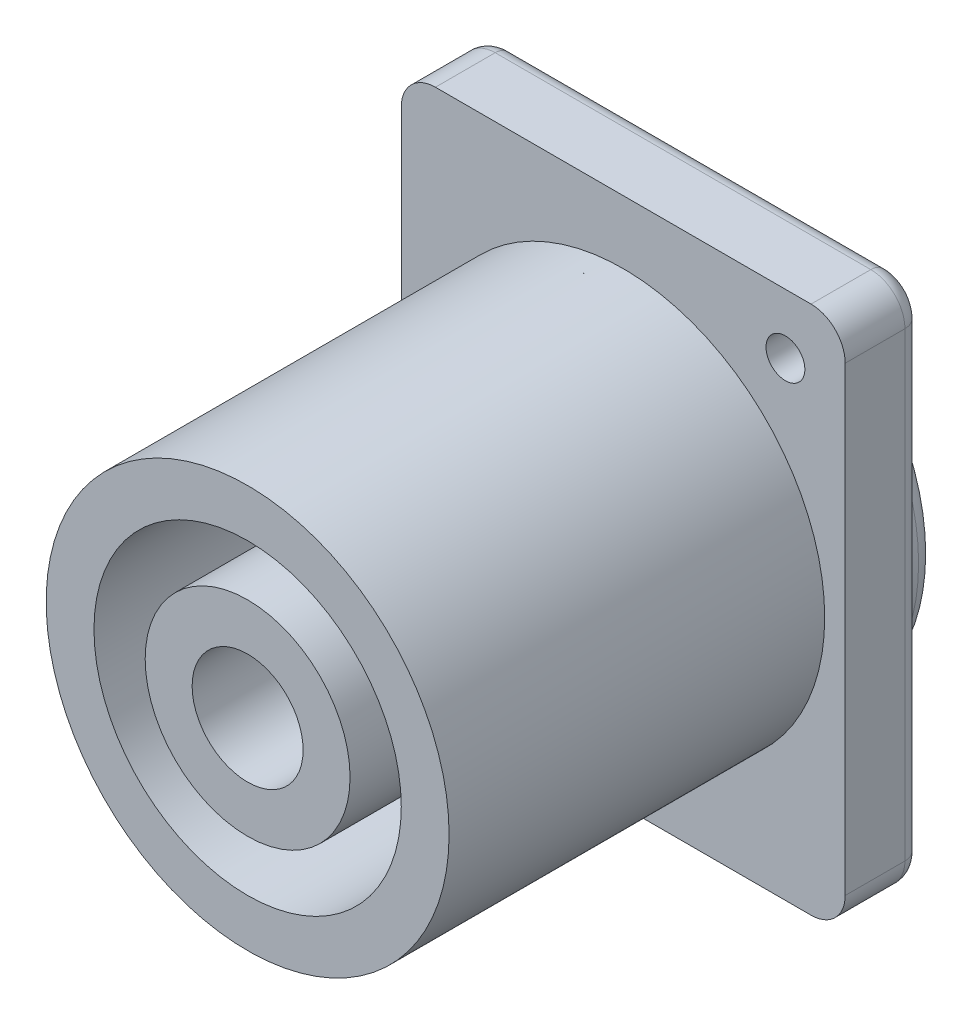
ISO-10303-21;
HEADER;
FILE_DESCRIPTION(('STEP AP214'),'2;1');
FILE_NAME('part.step','',(''),(''),'','','');
FILE_SCHEMA(('AUTOMOTIVE_DESIGN { 1 0 10303 214 1 1 1 1 }'));
ENDSEC;
DATA;
#1=APPLICATION_CONTEXT('core data for automotive mechanical design processes');
#2=APPLICATION_PROTOCOL_DEFINITION('international standard','automotive_design',2000,#1);
#3=PRODUCT_CONTEXT('',#1,'mechanical');
#4=PRODUCT('Part','Part','',(#3));
#5=PRODUCT_RELATED_PRODUCT_CATEGORY('part','',(#4));
#6=PRODUCT_DEFINITION_FORMATION('','',#4);
#7=PRODUCT_DEFINITION_CONTEXT('part definition',#1,'design');
#8=PRODUCT_DEFINITION('design','',#6,#7);
#9=PRODUCT_DEFINITION_SHAPE('','',#8);
#10=(LENGTH_UNIT() NAMED_UNIT(*) SI_UNIT(.MILLI.,.METRE.));
#11=(NAMED_UNIT(*) PLANE_ANGLE_UNIT() SI_UNIT($,.RADIAN.));
#12=(NAMED_UNIT(*) SI_UNIT($,.STERADIAN.) SOLID_ANGLE_UNIT());
#13=UNCERTAINTY_MEASURE_WITH_UNIT(LENGTH_MEASURE(1.E-05),#10,'distance_accuracy_value','');
#14=(GEOMETRIC_REPRESENTATION_CONTEXT(3) GLOBAL_UNCERTAINTY_ASSIGNED_CONTEXT((#13)) GLOBAL_UNIT_ASSIGNED_CONTEXT((#10,
#11,#12)) REPRESENTATION_CONTEXT('',''));
#15=CARTESIAN_POINT('',(0.,0.,0.));
#16=DIRECTION('',(0.,0.,1.));
#17=DIRECTION('',(1.,0.,0.));
#18=AXIS2_PLACEMENT_3D('',#15,#16,#17);
#19=CARTESIAN_POINT('',(0.,0.,4.5));
#20=DIRECTION('',(0.,0.,1.));
#21=DIRECTION('',(1.,0.,0.));
#22=AXIS2_PLACEMENT_3D('',#19,#20,#21);
#23=PLANE('',#22);
#24=CARTESIAN_POINT('',(-6.93648290047212,-3.7621359223301,4.5));
#25=DIRECTION('',(0.,0.,1.));
#26=DIRECTION('',(1.,0.,0.));
#27=AXIS2_PLACEMENT_3D('',#24,#25,#26);
#28=CIRCLE('',#27,11.8);
#29=CARTESIAN_POINT('',(4.86351709952788,-3.7621359223301,4.5));
#30=VERTEX_POINT('',#29);
#31=EDGE_CURVE('E257',#30,#30,#28,.T.);
#32=ORIENTED_EDGE('',*,*,#31,.F.);
#33=EDGE_LOOP('',(#32));
#34=FACE_BOUND('',#33,.T.);
#35=CARTESIAN_POINT('',(2.56351709952788,8.2378640776699,4.5));
#36=DIRECTION('',(0.,0.,1.));
#37=DIRECTION('',(1.,0.,0.));
#38=AXIS2_PLACEMENT_3D('',#35,#36,#37);
#39=CIRCLE('',#38,1.13750779244328);
#40=CARTESIAN_POINT('',(3.70102489197115,8.2378640776699,4.5));
#41=VERTEX_POINT('',#40);
#42=EDGE_CURVE('E239',#41,#41,#39,.T.);
#43=ORIENTED_EDGE('',*,*,#42,.F.);
#44=EDGE_LOOP('',(#43));
#45=FACE_BOUND('',#44,.T.);
#46=DIRECTION('',(0.,1.,0.));
#47=VECTOR('',#46,1.);
#48=CARTESIAN_POINT('',(6.06351709952788,11.7378640776699,4.5));
#49=LINE('',#48,#47);
#50=CARTESIAN_POINT('',(6.06351709952788,-17.2621359223301,4.5));
#51=VERTEX_POINT('',#50);
#52=CARTESIAN_POINT('',(6.06351709952788,9.7378640776699,4.5));
#53=VERTEX_POINT('',#52);
#54=EDGE_CURVE('E223',#51,#53,#49,.T.);
#55=ORIENTED_EDGE('',*,*,#54,.T.);
#56=CARTESIAN_POINT('',(4.06351709952788,9.7378640776699,4.5));
#57=DIRECTION('',(0.,0.,1.));
#58=DIRECTION('',(1.,0.,0.));
#59=AXIS2_PLACEMENT_3D('',#56,#57,#58);
#60=CIRCLE('',#59,2.);
#61=CARTESIAN_POINT('',(4.06351709952787,11.7378640776699,4.5));
#62=VERTEX_POINT('',#61);
#63=EDGE_CURVE('E219',#53,#62,#60,.T.);
#64=ORIENTED_EDGE('',*,*,#63,.T.);
#65=DIRECTION('',(-1.,0.,0.));
#66=VECTOR('',#65,1.);
#67=CARTESIAN_POINT('',(-19.9364829004721,11.7378640776699,4.5));
#68=LINE('',#67,#66);
#69=CARTESIAN_POINT('',(-17.9364829004721,11.7378640776699,4.5));
#70=VERTEX_POINT('',#69);
#71=EDGE_CURVE('E222',#62,#70,#68,.T.);
#72=ORIENTED_EDGE('',*,*,#71,.T.);
#73=CARTESIAN_POINT('',(-17.9364829004721,9.7378640776699,4.5));
#74=DIRECTION('',(0.,0.,1.));
#75=DIRECTION('',(1.,0.,0.));
#76=AXIS2_PLACEMENT_3D('',#73,#74,#75);
#77=CIRCLE('',#76,2.);
#78=CARTESIAN_POINT('',(-19.9364829004721,9.7378640776699,4.5));
#79=VERTEX_POINT('',#78);
#80=EDGE_CURVE('E229',#70,#79,#77,.T.);
#81=ORIENTED_EDGE('',*,*,#80,.T.);
#82=DIRECTION('',(0.,-1.,0.));
#83=VECTOR('',#82,1.);
#84=CARTESIAN_POINT('',(-19.9364829004721,11.7378640776699,4.5));
#85=LINE('',#84,#83);
#86=CARTESIAN_POINT('',(-19.9364829004721,-17.2621359223301,4.5));
#87=VERTEX_POINT('',#86);
#88=EDGE_CURVE('E228',#79,#87,#85,.T.);
#89=ORIENTED_EDGE('',*,*,#88,.T.);
#90=CARTESIAN_POINT('',(-17.9364829004721,-17.2621359223301,4.5));
#91=DIRECTION('',(0.,0.,1.));
#92=DIRECTION('',(1.,0.,0.));
#93=AXIS2_PLACEMENT_3D('',#90,#91,#92);
#94=CIRCLE('',#93,2.);
#95=CARTESIAN_POINT('',(-17.9364829004721,-19.2621359223301,4.5));
#96=VERTEX_POINT('',#95);
#97=EDGE_CURVE('E226',#87,#96,#94,.T.);
#98=ORIENTED_EDGE('',*,*,#97,.T.);
#99=DIRECTION('',(1.,0.,0.));
#100=VECTOR('',#99,1.);
#101=CARTESIAN_POINT('',(-19.9364829004721,-19.2621359223301,4.5));
#102=LINE('',#101,#100);
#103=CARTESIAN_POINT('',(4.06351709952787,-19.2621359223301,4.5));
#104=VERTEX_POINT('',#103);
#105=EDGE_CURVE('E225',#96,#104,#102,.T.);
#106=ORIENTED_EDGE('',*,*,#105,.T.);
#107=CARTESIAN_POINT('',(4.06351709952788,-17.2621359223301,4.5));
#108=DIRECTION('',(0.,0.,1.));
#109=DIRECTION('',(1.,0.,0.));
#110=AXIS2_PLACEMENT_3D('',#107,#108,#109);
#111=CIRCLE('',#110,2.);
#112=EDGE_CURVE('E163',#104,#51,#111,.T.);
#113=ORIENTED_EDGE('',*,*,#112,.T.);
#114=EDGE_LOOP('',(#55,#64,#72,#81,#89,#98,#106,#113));
#115=FACE_BOUND('',#114,.T.);
#116=CARTESIAN_POINT('',(-16.4364829004721,-15.7621359223301,4.5));
#117=DIRECTION('',(0.,0.,1.));
#118=DIRECTION('',(1.,0.,0.));
#119=AXIS2_PLACEMENT_3D('',#116,#117,#118);
#120=CIRCLE('',#119,1.23529565645922);
#121=CARTESIAN_POINT('',(-15.2011872440129,-15.7621359223301,4.5));
#122=VERTEX_POINT('',#121);
#123=EDGE_CURVE('E187',#122,#122,#120,.T.);
#124=ORIENTED_EDGE('',*,*,#123,.F.);
#125=EDGE_LOOP('',(#124));
#126=FACE_BOUND('',#125,.T.);
#127=ADVANCED_FACE('F50',(#34,#45,#115,#126),#23,.T.);
#128=CARTESIAN_POINT('',(0.,0.,0.));
#129=DIRECTION('',(0.,0.,1.));
#130=DIRECTION('',(1.,0.,0.));
#131=AXIS2_PLACEMENT_3D('',#128,#129,#130);
#132=PLANE('',#131);
#133=CARTESIAN_POINT('',(-6.93648290047212,-3.7621359223301,0.));
#134=DIRECTION('',(0.,0.,1.));
#135=DIRECTION('',(1.,0.,0.));
#136=AXIS2_PLACEMENT_3D('',#133,#134,#135);
#137=CIRCLE('',#136,11.8);
#138=CARTESIAN_POINT('',(4.86351709952789,-3.7621359223301,0.));
#139=VERTEX_POINT('',#138);
#140=EDGE_CURVE('E272',#139,#139,#137,.F.);
#141=ORIENTED_EDGE('',*,*,#140,.F.);
#142=EDGE_LOOP('',(#141));
#143=FACE_BOUND('',#142,.T.);
#144=DIRECTION('',(-1.,0.,0.));
#145=VECTOR('',#144,1.);
#146=CARTESIAN_POINT('',(0.,10.7378640776699,0.));
#147=LINE('',#146,#145);
#148=CARTESIAN_POINT('',(-17.9364829004721,10.7378640776699,0.));
#149=VERTEX_POINT('',#148);
#150=CARTESIAN_POINT('',(4.06351709952788,10.7378640776699,0.));
#151=VERTEX_POINT('',#150);
#152=EDGE_CURVE('E198',#149,#151,#147,.F.);
#153=ORIENTED_EDGE('',*,*,#152,.T.);
#154=CARTESIAN_POINT('',(4.06351709952788,9.7378640776699,0.));
#155=DIRECTION('',(0.,0.,1.));
#156=DIRECTION('',(1.,0.,0.));
#157=AXIS2_PLACEMENT_3D('',#154,#155,#156);
#158=CIRCLE('',#157,1.);
#159=CARTESIAN_POINT('',(5.06351709952788,9.7378640776699,0.));
#160=VERTEX_POINT('',#159);
#161=EDGE_CURVE('E194',#151,#160,#158,.F.);
#162=ORIENTED_EDGE('',*,*,#161,.T.);
#163=DIRECTION('',(0.,1.,0.));
#164=VECTOR('',#163,1.);
#165=CARTESIAN_POINT('',(5.06351709952788,0.,0.));
#166=LINE('',#165,#164);
#167=CARTESIAN_POINT('',(5.06351709952788,-17.2621359223301,0.));
#168=VERTEX_POINT('',#167);
#169=EDGE_CURVE('E197',#160,#168,#166,.F.);
#170=ORIENTED_EDGE('',*,*,#169,.T.);
#171=CARTESIAN_POINT('',(4.06351709952788,-17.2621359223301,0.));
#172=DIRECTION('',(0.,0.,1.));
#173=DIRECTION('',(1.,0.,0.));
#174=AXIS2_PLACEMENT_3D('',#171,#172,#173);
#175=CIRCLE('',#174,1.);
#176=CARTESIAN_POINT('',(4.06351709952788,-18.2621359223301,0.));
#177=VERTEX_POINT('',#176);
#178=EDGE_CURVE('E200',#168,#177,#175,.F.);
#179=ORIENTED_EDGE('',*,*,#178,.T.);
#180=DIRECTION('',(1.,0.,0.));
#181=VECTOR('',#180,1.);
#182=CARTESIAN_POINT('',(0.,-18.2621359223301,0.));
#183=LINE('',#182,#181);
#184=CARTESIAN_POINT('',(-17.9364829004721,-18.2621359223301,0.));
#185=VERTEX_POINT('',#184);
#186=EDGE_CURVE('E170',#177,#185,#183,.F.);
#187=ORIENTED_EDGE('',*,*,#186,.T.);
#188=CARTESIAN_POINT('',(-17.9364829004721,-17.2621359223301,0.));
#189=DIRECTION('',(0.,0.,1.));
#190=DIRECTION('',(1.,0.,0.));
#191=AXIS2_PLACEMENT_3D('',#188,#189,#190);
#192=CIRCLE('',#191,1.);
#193=CARTESIAN_POINT('',(-18.9364829004721,-17.2621359223301,0.));
#194=VERTEX_POINT('',#193);
#195=EDGE_CURVE('E203',#185,#194,#192,.F.);
#196=ORIENTED_EDGE('',*,*,#195,.T.);
#197=DIRECTION('',(0.,-1.,0.));
#198=VECTOR('',#197,1.);
#199=CARTESIAN_POINT('',(-18.9364829004721,0.,0.));
#200=LINE('',#199,#198);
#201=CARTESIAN_POINT('',(-18.9364829004721,9.7378640776699,0.));
#202=VERTEX_POINT('',#201);
#203=EDGE_CURVE('E205',#194,#202,#200,.F.);
#204=ORIENTED_EDGE('',*,*,#203,.T.);
#205=CARTESIAN_POINT('',(-17.9364829004721,9.7378640776699,0.));
#206=DIRECTION('',(0.,0.,1.));
#207=DIRECTION('',(1.,0.,0.));
#208=AXIS2_PLACEMENT_3D('',#205,#206,#207);
#209=CIRCLE('',#208,1.);
#210=EDGE_CURVE('E207',#202,#149,#209,.F.);
#211=ORIENTED_EDGE('',*,*,#210,.T.);
#212=EDGE_LOOP('',(#153,#162,#170,#179,#187,#196,#204,#211));
#213=FACE_BOUND('',#212,.T.);
#214=CARTESIAN_POINT('',(-16.4364829004721,-15.7621359223301,0.));
#215=DIRECTION('',(0.,0.,1.));
#216=DIRECTION('',(1.,0.,0.));
#217=AXIS2_PLACEMENT_3D('',#214,#215,#216);
#218=CIRCLE('',#217,2.23529565645922);
#219=CARTESIAN_POINT('',(-14.2011872440129,-15.7621359223301,0.));
#220=VERTEX_POINT('',#219);
#221=EDGE_CURVE('E209',#220,#220,#218,.T.);
#222=ORIENTED_EDGE('',*,*,#221,.T.);
#223=EDGE_LOOP('',(#222));
#224=FACE_BOUND('',#223,.T.);
#225=CARTESIAN_POINT('',(2.56351709952788,8.2378640776699,0.));
#226=DIRECTION('',(0.,0.,1.));
#227=DIRECTION('',(1.,0.,0.));
#228=AXIS2_PLACEMENT_3D('',#225,#226,#227);
#229=CIRCLE('',#228,2.13750779244328);
#230=CARTESIAN_POINT('',(4.70102489197116,8.2378640776699,0.));
#231=VERTEX_POINT('',#230);
#232=EDGE_CURVE('E216',#231,#231,#229,.T.);
#233=ORIENTED_EDGE('',*,*,#232,.T.);
#234=EDGE_LOOP('',(#233));
#235=FACE_BOUND('',#234,.T.);
#236=ADVANCED_FACE('F312',(#143,#213,#224,#235),#132,.F.);
#237=CARTESIAN_POINT('',(-19.9364829004721,11.7378640776699,4.5));
#238=DIRECTION('',(1.,0.,0.));
#239=DIRECTION('',(0.,1.,0.));
#240=AXIS2_PLACEMENT_3D('',#237,#238,#239);
#241=PLANE('',#240);
#242=DIRECTION('',(0.,0.,-1.));
#243=VECTOR('',#242,1.);
#244=CARTESIAN_POINT('',(-19.9364829004721,9.7378640776699,4.5));
#245=LINE('',#244,#243);
#246=CARTESIAN_POINT('',(-19.9364829004721,9.7378640776699,1.));
#247=VERTEX_POINT('',#246);
#248=EDGE_CURVE('E214',#79,#247,#245,.T.);
#249=ORIENTED_EDGE('',*,*,#248,.T.);
#250=DIRECTION('',(0.,-1.,0.));
#251=VECTOR('',#250,1.);
#252=CARTESIAN_POINT('',(-19.9364829004721,11.7378640776699,1.));
#253=LINE('',#252,#251);
#254=CARTESIAN_POINT('',(-19.9364829004721,-17.2621359223301,1.));
#255=VERTEX_POINT('',#254);
#256=EDGE_CURVE('E213',#247,#255,#253,.T.);
#257=ORIENTED_EDGE('',*,*,#256,.T.);
#258=DIRECTION('',(0.,0.,-1.));
#259=VECTOR('',#258,1.);
#260=CARTESIAN_POINT('',(-19.9364829004721,-17.2621359223301,4.5));
#261=LINE('',#260,#259);
#262=EDGE_CURVE('E211',#255,#87,#261,.F.);
#263=ORIENTED_EDGE('',*,*,#262,.T.);
#264=ORIENTED_EDGE('',*,*,#88,.F.);
#265=EDGE_LOOP('',(#249,#257,#263,#264));
#266=FACE_BOUND('',#265,.T.);
#267=ADVANCED_FACE('F295',(#266),#241,.F.);
#268=CARTESIAN_POINT('',(-19.9364829004721,-19.2621359223301,4.5));
#269=DIRECTION('',(0.,1.,0.));
#270=DIRECTION('',(0.,0.,1.));
#271=AXIS2_PLACEMENT_3D('',#268,#269,#270);
#272=PLANE('',#271);
#273=DIRECTION('',(0.,0.,-1.));
#274=VECTOR('',#273,1.);
#275=CARTESIAN_POINT('',(-17.9364829004721,-19.2621359223301,4.5));
#276=LINE('',#275,#274);
#277=CARTESIAN_POINT('',(-17.9364829004721,-19.2621359223301,1.));
#278=VERTEX_POINT('',#277);
#279=EDGE_CURVE('E150',#96,#278,#276,.T.);
#280=ORIENTED_EDGE('',*,*,#279,.T.);
#281=DIRECTION('',(1.,0.,0.));
#282=VECTOR('',#281,1.);
#283=CARTESIAN_POINT('',(-19.9364829004721,-19.2621359223301,1.));
#284=LINE('',#283,#282);
#285=CARTESIAN_POINT('',(4.06351709952788,-19.2621359223301,1.));
#286=VERTEX_POINT('',#285);
#287=EDGE_CURVE('E143',#278,#286,#284,.T.);
#288=ORIENTED_EDGE('',*,*,#287,.T.);
#289=DIRECTION('',(0.,0.,-1.));
#290=VECTOR('',#289,1.);
#291=CARTESIAN_POINT('',(4.06351709952788,-19.2621359223301,4.5));
#292=LINE('',#291,#290);
#293=EDGE_CURVE('E147',#286,#104,#292,.F.);
#294=ORIENTED_EDGE('',*,*,#293,.T.);
#295=ORIENTED_EDGE('',*,*,#105,.F.);
#296=EDGE_LOOP('',(#280,#288,#294,#295));
#297=FACE_BOUND('',#296,.T.);
#298=ADVANCED_FACE('F145',(#297),#272,.F.);
#299=CARTESIAN_POINT('',(6.06351709952788,11.7378640776699,4.5));
#300=DIRECTION('',(-1.,0.,0.));
#301=DIRECTION('',(0.,-1.,0.));
#302=AXIS2_PLACEMENT_3D('',#299,#300,#301);
#303=PLANE('',#302);
#304=DIRECTION('',(0.,0.,-1.));
#305=VECTOR('',#304,1.);
#306=CARTESIAN_POINT('',(6.06351709952788,-17.2621359223301,4.5));
#307=LINE('',#306,#305);
#308=CARTESIAN_POINT('',(6.06351709952788,-17.2621359223301,1.));
#309=VERTEX_POINT('',#308);
#310=EDGE_CURVE('E164',#51,#309,#307,.T.);
#311=ORIENTED_EDGE('',*,*,#310,.T.);
#312=DIRECTION('',(0.,1.,0.));
#313=VECTOR('',#312,1.);
#314=CARTESIAN_POINT('',(6.06351709952788,11.7378640776699,1.));
#315=LINE('',#314,#313);
#316=CARTESIAN_POINT('',(6.06351709952788,9.7378640776699,1.));
#317=VERTEX_POINT('',#316);
#318=EDGE_CURVE('E190',#309,#317,#315,.T.);
#319=ORIENTED_EDGE('',*,*,#318,.T.);
#320=DIRECTION('',(0.,0.,-1.));
#321=VECTOR('',#320,1.);
#322=CARTESIAN_POINT('',(6.06351709952788,9.7378640776699,4.5));
#323=LINE('',#322,#321);
#324=EDGE_CURVE('E192',#317,#53,#323,.F.);
#325=ORIENTED_EDGE('',*,*,#324,.T.);
#326=ORIENTED_EDGE('',*,*,#54,.F.);
#327=EDGE_LOOP('',(#311,#319,#325,#326));
#328=FACE_BOUND('',#327,.T.);
#329=ADVANCED_FACE('F319',(#328),#303,.F.);
#330=CARTESIAN_POINT('',(-19.9364829004721,11.7378640776699,4.5));
#331=DIRECTION('',(0.,-1.,0.));
#332=DIRECTION('',(0.,0.,-1.));
#333=AXIS2_PLACEMENT_3D('',#330,#331,#332);
#334=PLANE('',#333);
#335=DIRECTION('',(0.,0.,-1.));
#336=VECTOR('',#335,1.);
#337=CARTESIAN_POINT('',(4.06351709952788,11.7378640776699,4.5));
#338=LINE('',#337,#336);
#339=CARTESIAN_POINT('',(4.06351709952788,11.7378640776699,1.));
#340=VERTEX_POINT('',#339);
#341=EDGE_CURVE('E232',#62,#340,#338,.T.);
#342=ORIENTED_EDGE('',*,*,#341,.T.);
#343=DIRECTION('',(-1.,0.,0.));
#344=VECTOR('',#343,1.);
#345=CARTESIAN_POINT('',(-19.9364829004721,11.7378640776699,1.));
#346=LINE('',#345,#344);
#347=CARTESIAN_POINT('',(-17.9364829004721,11.7378640776699,1.));
#348=VERTEX_POINT('',#347);
#349=EDGE_CURVE('E131',#340,#348,#346,.T.);
#350=ORIENTED_EDGE('',*,*,#349,.T.);
#351=DIRECTION('',(0.,0.,-1.));
#352=VECTOR('',#351,1.);
#353=CARTESIAN_POINT('',(-17.9364829004721,11.7378640776699,4.5));
#354=LINE('',#353,#352);
#355=EDGE_CURVE('E123',#348,#70,#354,.F.);
#356=ORIENTED_EDGE('',*,*,#355,.T.);
#357=ORIENTED_EDGE('',*,*,#71,.F.);
#358=EDGE_LOOP('',(#342,#350,#356,#357));
#359=FACE_BOUND('',#358,.T.);
#360=ADVANCED_FACE('F338',(#359),#334,.F.);
#361=CARTESIAN_POINT('',(2.56351709952788,8.2378640776699,4.5));
#362=DIRECTION('',(0.,0.,-1.));
#363=DIRECTION('',(-1.,0.,0.));
#364=AXIS2_PLACEMENT_3D('',#361,#362,#363);
#365=CYLINDRICAL_SURFACE('',#364,1.13750779244328);
#366=CARTESIAN_POINT('',(2.56351709952788,8.2378640776699,1.00000000000001));
#367=DIRECTION('',(0.,0.,1.));
#368=DIRECTION('',(1.,0.,0.));
#369=AXIS2_PLACEMENT_3D('',#366,#367,#368);
#370=CIRCLE('',#369,1.13750779244328);
#371=CARTESIAN_POINT('',(3.70102489197115,8.2378640776699,1.00000000000001));
#372=VERTEX_POINT('',#371);
#373=EDGE_CURVE('E236',#372,#372,#370,.F.);
#374=ORIENTED_EDGE('',*,*,#373,.T.);
#375=EDGE_LOOP('',(#374));
#376=FACE_BOUND('',#375,.T.);
#377=ORIENTED_EDGE('',*,*,#42,.T.);
#378=EDGE_LOOP('',(#377));
#379=FACE_BOUND('',#378,.T.);
#380=ADVANCED_FACE('F340',(#376,#379),#365,.F.);
#381=CARTESIAN_POINT('',(-16.4364829004721,-15.7621359223301,4.5));
#382=DIRECTION('',(0.,0.,-1.));
#383=DIRECTION('',(-1.,0.,0.));
#384=AXIS2_PLACEMENT_3D('',#381,#382,#383);
#385=CYLINDRICAL_SURFACE('',#384,1.23529565645922);
#386=CARTESIAN_POINT('',(-16.4364829004721,-15.7621359223301,1.00000000000001));
#387=DIRECTION('',(0.,0.,1.));
#388=DIRECTION('',(1.,0.,0.));
#389=AXIS2_PLACEMENT_3D('',#386,#387,#388);
#390=CIRCLE('',#389,1.23529565645922);
#391=CARTESIAN_POINT('',(-15.2011872440129,-15.7621359223301,1.00000000000001));
#392=VERTEX_POINT('',#391);
#393=EDGE_CURVE('E240',#392,#392,#390,.F.);
#394=ORIENTED_EDGE('',*,*,#393,.T.);
#395=EDGE_LOOP('',(#394));
#396=FACE_BOUND('',#395,.T.);
#397=ORIENTED_EDGE('',*,*,#123,.T.);
#398=EDGE_LOOP('',(#397));
#399=FACE_BOUND('',#398,.T.);
#400=ADVANCED_FACE('F346',(#396,#399),#385,.F.);
#401=CARTESIAN_POINT('',(-16.4364829004721,-15.7621359223301,0.));
#402=DIRECTION('',(0.,0.,-1.));
#403=DIRECTION('',(-1.,0.,0.));
#404=AXIS2_PLACEMENT_3D('',#401,#402,#403);
#405=CONICAL_SURFACE('',#404,2.23529565645922,0.785398163397447);
#406=ORIENTED_EDGE('',*,*,#393,.F.);
#407=EDGE_LOOP('',(#406));
#408=FACE_BOUND('',#407,.T.);
#409=ORIENTED_EDGE('',*,*,#221,.F.);
#410=EDGE_LOOP('',(#409));
#411=FACE_BOUND('',#410,.T.);
#412=ADVANCED_FACE('F363',(#408,#411),#405,.F.);
#413=CARTESIAN_POINT('',(2.56351709952788,8.2378640776699,0.));
#414=DIRECTION('',(0.,0.,-1.));
#415=DIRECTION('',(-1.,0.,0.));
#416=AXIS2_PLACEMENT_3D('',#413,#414,#415);
#417=CONICAL_SURFACE('',#416,2.13750779244328,0.785398163397445);
#418=ORIENTED_EDGE('',*,*,#373,.F.);
#419=EDGE_LOOP('',(#418));
#420=FACE_BOUND('',#419,.T.);
#421=ORIENTED_EDGE('',*,*,#232,.F.);
#422=EDGE_LOOP('',(#421));
#423=FACE_BOUND('',#422,.T.);
#424=ADVANCED_FACE('F508',(#420,#423),#417,.F.);
#425=CARTESIAN_POINT('',(4.06351709952788,9.7378640776699,4.5));
#426=DIRECTION('',(0.,0.,-1.));
#427=DIRECTION('',(-1.,0.,0.));
#428=AXIS2_PLACEMENT_3D('',#425,#426,#427);
#429=CYLINDRICAL_SURFACE('',#428,2.);
#430=ORIENTED_EDGE('',*,*,#324,.F.);
#431=CARTESIAN_POINT('',(4.06351709952788,9.7378640776699,1.));
#432=DIRECTION('',(0.,0.,1.));
#433=DIRECTION('',(1.,0.,0.));
#434=AXIS2_PLACEMENT_3D('',#431,#432,#433);
#435=CIRCLE('',#434,2.);
#436=EDGE_CURVE('E182',#317,#340,#435,.T.);
#437=ORIENTED_EDGE('',*,*,#436,.T.);
#438=ORIENTED_EDGE('',*,*,#341,.F.);
#439=ORIENTED_EDGE('',*,*,#63,.F.);
#440=EDGE_LOOP('',(#430,#437,#438,#439));
#441=FACE_BOUND('',#440,.T.);
#442=ADVANCED_FACE('F323',(#441),#429,.T.);
#443=CARTESIAN_POINT('',(4.06351709952788,-17.2621359223301,4.5));
#444=DIRECTION('',(0.,0.,-1.));
#445=DIRECTION('',(-1.,0.,0.));
#446=AXIS2_PLACEMENT_3D('',#443,#444,#445);
#447=CYLINDRICAL_SURFACE('',#446,2.);
#448=ORIENTED_EDGE('',*,*,#293,.F.);
#449=CARTESIAN_POINT('',(4.06351709952788,-17.2621359223301,1.));
#450=DIRECTION('',(0.,0.,1.));
#451=DIRECTION('',(1.,0.,0.));
#452=AXIS2_PLACEMENT_3D('',#449,#450,#451);
#453=CIRCLE('',#452,2.);
#454=EDGE_CURVE('E161',#286,#309,#453,.T.);
#455=ORIENTED_EDGE('',*,*,#454,.T.);
#456=ORIENTED_EDGE('',*,*,#310,.F.);
#457=ORIENTED_EDGE('',*,*,#112,.F.);
#458=EDGE_LOOP('',(#448,#455,#456,#457));
#459=FACE_BOUND('',#458,.T.);
#460=ADVANCED_FACE('F158',(#459),#447,.T.);
#461=CARTESIAN_POINT('',(-17.9364829004721,-17.2621359223301,4.5));
#462=DIRECTION('',(0.,0.,-1.));
#463=DIRECTION('',(-1.,0.,0.));
#464=AXIS2_PLACEMENT_3D('',#461,#462,#463);
#465=CYLINDRICAL_SURFACE('',#464,2.);
#466=ORIENTED_EDGE('',*,*,#262,.F.);
#467=CARTESIAN_POINT('',(-17.9364829004721,-17.2621359223301,1.));
#468=DIRECTION('',(0.,0.,1.));
#469=DIRECTION('',(1.,0.,0.));
#470=AXIS2_PLACEMENT_3D('',#467,#468,#469);
#471=CIRCLE('',#470,2.);
#472=EDGE_CURVE('E181',#255,#278,#471,.T.);
#473=ORIENTED_EDGE('',*,*,#472,.T.);
#474=ORIENTED_EDGE('',*,*,#279,.F.);
#475=ORIENTED_EDGE('',*,*,#97,.F.);
#476=EDGE_LOOP('',(#466,#473,#474,#475));
#477=FACE_BOUND('',#476,.T.);
#478=ADVANCED_FACE('F303',(#477),#465,.T.);
#479=CARTESIAN_POINT('',(-17.9364829004721,9.7378640776699,4.5));
#480=DIRECTION('',(0.,0.,-1.));
#481=DIRECTION('',(-1.,0.,0.));
#482=AXIS2_PLACEMENT_3D('',#479,#480,#481);
#483=CYLINDRICAL_SURFACE('',#482,2.);
#484=ORIENTED_EDGE('',*,*,#355,.F.);
#485=CARTESIAN_POINT('',(-17.9364829004721,9.7378640776699,1.));
#486=DIRECTION('',(0.,0.,1.));
#487=DIRECTION('',(1.,0.,0.));
#488=AXIS2_PLACEMENT_3D('',#485,#486,#487);
#489=CIRCLE('',#488,2.);
#490=EDGE_CURVE('E184',#348,#247,#489,.T.);
#491=ORIENTED_EDGE('',*,*,#490,.T.);
#492=ORIENTED_EDGE('',*,*,#248,.F.);
#493=ORIENTED_EDGE('',*,*,#80,.F.);
#494=EDGE_LOOP('',(#484,#491,#492,#493));
#495=FACE_BOUND('',#494,.T.);
#496=ADVANCED_FACE('F334',(#495),#483,.T.);
#497=CARTESIAN_POINT('',(-17.9364829004721,-17.2621359223301,1.));
#498=DIRECTION('',(0.,0.,1.));
#499=DIRECTION('',(1.,0.,0.));
#500=AXIS2_PLACEMENT_3D('',#497,#498,#499);
#501=DEGENERATE_TOROIDAL_SURFACE('',#500,1.,1.,.T.);
#502=CARTESIAN_POINT('',(-17.9364829004721,-18.2621359223301,1.));
#503=DIRECTION('',(1.,0.,0.));
#504=DIRECTION('',(0.,0.,-1.));
#505=AXIS2_PLACEMENT_3D('',#502,#503,#504);
#506=CIRCLE('',#505,1.);
#507=EDGE_CURVE('E280',#278,#185,#506,.T.);
#508=ORIENTED_EDGE('',*,*,#507,.F.);
#509=ORIENTED_EDGE('',*,*,#472,.F.);
#510=CARTESIAN_POINT('',(-18.9364829004721,-17.2621359223301,1.));
#511=DIRECTION('',(0.,1.,0.));
#512=DIRECTION('',(0.,0.,1.));
#513=AXIS2_PLACEMENT_3D('',#510,#511,#512);
#514=CIRCLE('',#513,1.);
#515=EDGE_CURVE('E277',#194,#255,#514,.T.);
#516=ORIENTED_EDGE('',*,*,#515,.F.);
#517=ORIENTED_EDGE('',*,*,#195,.F.);
#518=EDGE_LOOP('',(#508,#509,#516,#517));
#519=FACE_BOUND('',#518,.T.);
#520=ADVANCED_FACE('F306',(#519),#501,.T.);
#521=CARTESIAN_POINT('',(-18.9364829004721,11.7378640776699,1.));
#522=DIRECTION('',(0.,-1.,0.));
#523=DIRECTION('',(1.,0.,0.));
#524=AXIS2_PLACEMENT_3D('',#521,#522,#523);
#525=CYLINDRICAL_SURFACE('',#524,1.);
#526=ORIENTED_EDGE('',*,*,#515,.T.);
#527=ORIENTED_EDGE('',*,*,#256,.F.);
#528=CARTESIAN_POINT('',(-18.9364829004721,9.7378640776699,1.));
#529=DIRECTION('',(0.,1.,0.));
#530=DIRECTION('',(0.,0.,1.));
#531=AXIS2_PLACEMENT_3D('',#528,#529,#530);
#532=CIRCLE('',#531,1.);
#533=EDGE_CURVE('E174',#202,#247,#532,.T.);
#534=ORIENTED_EDGE('',*,*,#533,.F.);
#535=ORIENTED_EDGE('',*,*,#203,.F.);
#536=EDGE_LOOP('',(#526,#527,#534,#535));
#537=FACE_BOUND('',#536,.T.);
#538=ADVANCED_FACE('F309',(#537),#525,.T.);
#539=CARTESIAN_POINT('',(-19.9364829004721,-18.2621359223301,1.));
#540=DIRECTION('',(1.,0.,0.));
#541=DIRECTION('',(0.,0.,-1.));
#542=AXIS2_PLACEMENT_3D('',#539,#540,#541);
#543=CYLINDRICAL_SURFACE('',#542,1.);
#544=ORIENTED_EDGE('',*,*,#507,.T.);
#545=ORIENTED_EDGE('',*,*,#186,.F.);
#546=CARTESIAN_POINT('',(4.06351709952788,-18.2621359223301,1.));
#547=DIRECTION('',(1.,0.,0.));
#548=DIRECTION('',(0.,0.,-1.));
#549=AXIS2_PLACEMENT_3D('',#546,#547,#548);
#550=CIRCLE('',#549,1.);
#551=EDGE_CURVE('E168',#286,#177,#550,.T.);
#552=ORIENTED_EDGE('',*,*,#551,.F.);
#553=ORIENTED_EDGE('',*,*,#287,.F.);
#554=EDGE_LOOP('',(#544,#545,#552,#553));
#555=FACE_BOUND('',#554,.T.);
#556=ADVANCED_FACE('F169',(#555),#543,.T.);
#557=CARTESIAN_POINT('',(-17.9364829004721,9.7378640776699,1.));
#558=DIRECTION('',(0.,0.,1.));
#559=DIRECTION('',(1.,0.,0.));
#560=AXIS2_PLACEMENT_3D('',#557,#558,#559);
#561=DEGENERATE_TOROIDAL_SURFACE('',#560,1.,1.,.T.);
#562=ORIENTED_EDGE('',*,*,#533,.T.);
#563=ORIENTED_EDGE('',*,*,#490,.F.);
#564=CARTESIAN_POINT('',(-17.9364829004721,10.7378640776699,1.));
#565=DIRECTION('',(1.,0.,0.));
#566=DIRECTION('',(0.,0.,-1.));
#567=AXIS2_PLACEMENT_3D('',#564,#565,#566);
#568=CIRCLE('',#567,1.);
#569=EDGE_CURVE('E173',#149,#348,#568,.T.);
#570=ORIENTED_EDGE('',*,*,#569,.F.);
#571=ORIENTED_EDGE('',*,*,#210,.F.);
#572=EDGE_LOOP('',(#562,#563,#570,#571));
#573=FACE_BOUND('',#572,.T.);
#574=ADVANCED_FACE('F332',(#573),#561,.T.);
#575=CARTESIAN_POINT('',(4.06351709952788,-17.2621359223301,1.));
#576=DIRECTION('',(0.,0.,1.));
#577=DIRECTION('',(1.,0.,0.));
#578=AXIS2_PLACEMENT_3D('',#575,#576,#577);
#579=DEGENERATE_TOROIDAL_SURFACE('',#578,1.,1.,.T.);
#580=ORIENTED_EDGE('',*,*,#551,.T.);
#581=ORIENTED_EDGE('',*,*,#178,.F.);
#582=CARTESIAN_POINT('',(5.06351709952788,-17.2621359223301,1.));
#583=DIRECTION('',(0.,1.,0.));
#584=DIRECTION('',(0.,0.,1.));
#585=AXIS2_PLACEMENT_3D('',#582,#583,#584);
#586=CIRCLE('',#585,1.);
#587=EDGE_CURVE('E179',#309,#168,#586,.T.);
#588=ORIENTED_EDGE('',*,*,#587,.F.);
#589=ORIENTED_EDGE('',*,*,#454,.F.);
#590=EDGE_LOOP('',(#580,#581,#588,#589));
#591=FACE_BOUND('',#590,.T.);
#592=ADVANCED_FACE('F177',(#591),#579,.T.);
#593=CARTESIAN_POINT('',(-19.9364829004721,10.7378640776699,1.));
#594=DIRECTION('',(-1.,0.,0.));
#595=DIRECTION('',(0.,0.,1.));
#596=AXIS2_PLACEMENT_3D('',#593,#594,#595);
#597=CYLINDRICAL_SURFACE('',#596,1.);
#598=ORIENTED_EDGE('',*,*,#569,.T.);
#599=ORIENTED_EDGE('',*,*,#349,.F.);
#600=CARTESIAN_POINT('',(4.06351709952788,10.7378640776699,1.));
#601=DIRECTION('',(1.,0.,0.));
#602=DIRECTION('',(0.,0.,-1.));
#603=AXIS2_PLACEMENT_3D('',#600,#601,#602);
#604=CIRCLE('',#603,1.);
#605=EDGE_CURVE('E287',#151,#340,#604,.T.);
#606=ORIENTED_EDGE('',*,*,#605,.F.);
#607=ORIENTED_EDGE('',*,*,#152,.F.);
#608=EDGE_LOOP('',(#598,#599,#606,#607));
#609=FACE_BOUND('',#608,.T.);
#610=ADVANCED_FACE('F329',(#609),#597,.T.);
#611=CARTESIAN_POINT('',(5.06351709952788,11.7378640776699,1.));
#612=DIRECTION('',(0.,1.,0.));
#613=DIRECTION('',(-1.,0.,0.));
#614=AXIS2_PLACEMENT_3D('',#611,#612,#613);
#615=CYLINDRICAL_SURFACE('',#614,1.);
#616=ORIENTED_EDGE('',*,*,#587,.T.);
#617=ORIENTED_EDGE('',*,*,#169,.F.);
#618=CARTESIAN_POINT('',(5.06351709952788,9.7378640776699,1.));
#619=DIRECTION('',(0.,1.,0.));
#620=DIRECTION('',(0.,0.,1.));
#621=AXIS2_PLACEMENT_3D('',#618,#619,#620);
#622=CIRCLE('',#621,1.);
#623=EDGE_CURVE('E67',#317,#160,#622,.T.);
#624=ORIENTED_EDGE('',*,*,#623,.F.);
#625=ORIENTED_EDGE('',*,*,#318,.F.);
#626=EDGE_LOOP('',(#616,#617,#624,#625));
#627=FACE_BOUND('',#626,.T.);
#628=ADVANCED_FACE('F316',(#627),#615,.T.);
#629=CARTESIAN_POINT('',(4.06351709952788,9.7378640776699,1.));
#630=DIRECTION('',(0.,0.,1.));
#631=DIRECTION('',(1.,0.,0.));
#632=AXIS2_PLACEMENT_3D('',#629,#630,#631);
#633=DEGENERATE_TOROIDAL_SURFACE('',#632,1.,1.,.T.);
#634=ORIENTED_EDGE('',*,*,#605,.T.);
#635=ORIENTED_EDGE('',*,*,#436,.F.);
#636=ORIENTED_EDGE('',*,*,#623,.T.);
#637=ORIENTED_EDGE('',*,*,#161,.F.);
#638=EDGE_LOOP('',(#634,#635,#636,#637));
#639=FACE_BOUND('',#638,.T.);
#640=ADVANCED_FACE('F325',(#639),#633,.T.);
#641=CARTESIAN_POINT('',(-6.93648290047212,-3.7621359223301,-2.));
#642=DIRECTION('',(0.,0.,1.));
#643=DIRECTION('',(1.,0.,0.));
#644=AXIS2_PLACEMENT_3D('',#641,#642,#643);
#645=CYLINDRICAL_SURFACE('',#644,11.8);
#646=CARTESIAN_POINT('',(-6.93648290047212,-3.7621359223301,-1.));
#647=DIRECTION('',(0.,0.,-1.));
#648=DIRECTION('',(-1.,0.,0.));
#649=AXIS2_PLACEMENT_3D('',#646,#647,#648);
#650=CIRCLE('',#649,11.8);
#651=CARTESIAN_POINT('',(-18.7364829004721,-3.7621359223301,-1.));
#652=VERTEX_POINT('',#651);
#653=EDGE_CURVE('E269',#652,#652,#650,.F.);
#654=ORIENTED_EDGE('',*,*,#653,.T.);
#655=EDGE_LOOP('',(#654));
#656=FACE_BOUND('',#655,.T.);
#657=ORIENTED_EDGE('',*,*,#140,.T.);
#658=EDGE_LOOP('',(#657));
#659=FACE_BOUND('',#658,.T.);
#660=ADVANCED_FACE('F365',(#656,#659),#645,.T.);
#661=CARTESIAN_POINT('',(-6.93648290047212,-3.7621359223301,-2.));
#662=DIRECTION('',(0.,0.,-1.));
#663=DIRECTION('',(-1.,0.,0.));
#664=AXIS2_PLACEMENT_3D('',#661,#662,#663);
#665=PLANE('',#664);
#666=CARTESIAN_POINT('',(-6.93648290047212,-3.7621359223301,-2.));
#667=DIRECTION('',(0.,0.,-1.));
#668=DIRECTION('',(-1.,0.,0.));
#669=AXIS2_PLACEMENT_3D('',#666,#667,#668);
#670=CIRCLE('',#669,9.);
#671=CARTESIAN_POINT('',(-15.9364829004721,-3.7621359223301,-2.));
#672=VERTEX_POINT('',#671);
#673=EDGE_CURVE('E13',#672,#672,#670,.T.);
#674=ORIENTED_EDGE('',*,*,#673,.F.);
#675=EDGE_LOOP('',(#674));
#676=FACE_BOUND('',#675,.T.);
#677=CARTESIAN_POINT('',(-6.93648290047212,-3.7621359223301,-2.));
#678=DIRECTION('',(0.,0.,-1.));
#679=DIRECTION('',(-1.,0.,0.));
#680=AXIS2_PLACEMENT_3D('',#677,#678,#679);
#681=CIRCLE('',#680,10.8);
#682=CARTESIAN_POINT('',(-17.7364829004721,-3.7621359223301,-2.));
#683=VERTEX_POINT('',#682);
#684=EDGE_CURVE('E260',#683,#683,#681,.T.);
#685=ORIENTED_EDGE('',*,*,#684,.T.);
#686=EDGE_LOOP('',(#685));
#687=FACE_BOUND('',#686,.T.);
#688=ADVANCED_FACE('F52',(#676,#687),#665,.T.);
#689=CARTESIAN_POINT('',(-6.93648290047212,-3.7621359223301,-1.));
#690=DIRECTION('',(0.,0.,-1.));
#691=DIRECTION('',(-1.,0.,0.));
#692=AXIS2_PLACEMENT_3D('',#689,#690,#691);
#693=TOROIDAL_SURFACE('',#692,10.8,1.);
#694=ORIENTED_EDGE('',*,*,#653,.F.);
#695=EDGE_LOOP('',(#694));
#696=FACE_BOUND('',#695,.T.);
#697=ORIENTED_EDGE('',*,*,#684,.F.);
#698=EDGE_LOOP('',(#697));
#699=FACE_BOUND('',#698,.T.);
#700=ADVANCED_FACE('F373',(#696,#699),#693,.T.);
#701=CARTESIAN_POINT('',(-6.93648290047212,-3.7621359223301,26.5));
#702=DIRECTION('',(0.,0.,-1.));
#703=DIRECTION('',(-1.,0.,0.));
#704=AXIS2_PLACEMENT_3D('',#701,#702,#703);
#705=CYLINDRICAL_SURFACE('',#704,11.8);
#706=CARTESIAN_POINT('',(-6.93648290047212,-3.7621359223301,26.5));
#707=DIRECTION('',(0.,0.,1.));
#708=DIRECTION('',(1.,0.,0.));
#709=AXIS2_PLACEMENT_3D('',#706,#707,#708);
#710=CIRCLE('',#709,11.8);
#711=CARTESIAN_POINT('',(4.86351709952788,-3.7621359223301,26.5));
#712=VERTEX_POINT('',#711);
#713=EDGE_CURVE('E259',#712,#712,#710,.T.);
#714=ORIENTED_EDGE('',*,*,#713,.F.);
#715=EDGE_LOOP('',(#714));
#716=FACE_BOUND('',#715,.T.);
#717=ORIENTED_EDGE('',*,*,#31,.T.);
#718=EDGE_LOOP('',(#717));
#719=FACE_BOUND('',#718,.T.);
#720=ADVANCED_FACE('F369',(#716,#719),#705,.T.);
#721=CARTESIAN_POINT('',(-6.93648290047212,-3.7621359223301,26.5));
#722=DIRECTION('',(0.,0.,1.));
#723=DIRECTION('',(1.,0.,0.));
#724=AXIS2_PLACEMENT_3D('',#721,#722,#723);
#725=PLANE('',#724);
#726=CARTESIAN_POINT('',(-6.93648290047212,-3.7621359223301,26.5));
#727=DIRECTION('',(0.,0.,1.));
#728=DIRECTION('',(1.,0.,0.));
#729=AXIS2_PLACEMENT_3D('',#726,#727,#728);
#730=CIRCLE('',#729,9.);
#731=CARTESIAN_POINT('',(2.06351709952788,-3.7621359223301,26.5));
#732=VERTEX_POINT('',#731);
#733=EDGE_CURVE('E59',#732,#732,#730,.T.);
#734=ORIENTED_EDGE('',*,*,#733,.F.);
#735=EDGE_LOOP('',(#734));
#736=FACE_BOUND('',#735,.T.);
#737=ORIENTED_EDGE('',*,*,#713,.T.);
#738=EDGE_LOOP('',(#737));
#739=FACE_BOUND('',#738,.T.);
#740=ADVANCED_FACE('F372',(#736,#739),#725,.T.);
#741=CARTESIAN_POINT('',(-6.93648290047212,-3.7621359223301,28.));
#742=DIRECTION('',(0.,0.,-1.));
#743=DIRECTION('',(-1.,0.,0.));
#744=AXIS2_PLACEMENT_3D('',#741,#742,#743);
#745=CYLINDRICAL_SURFACE('',#744,9.);
#746=ORIENTED_EDGE('',*,*,#733,.T.);
#747=EDGE_LOOP('',(#746));
#748=FACE_BOUND('',#747,.T.);
#749=ORIENTED_EDGE('',*,*,#673,.T.);
#750=EDGE_LOOP('',(#749));
#751=FACE_BOUND('',#750,.T.);
#752=ADVANCED_FACE('F375',(#748,#751),#745,.F.);
#753=CLOSED_SHELL('',(#127,#236,#267,#298,#329,#360,#380,#400,#412,#424,#442,#460,#478,#496,
#520,#538,#556,#574,#592,#610,#628,#640,#660,#688,#700,#720,#740,#752));
#754=MANIFOLD_SOLID_BREP('B2',#753);
#755=CARTESIAN_POINT('',(-6.93648290047212,-3.7621359223301,26.5));
#756=DIRECTION('',(0.,0.,1.));
#757=DIRECTION('',(1.,0.,0.));
#758=AXIS2_PLACEMENT_3D('',#755,#756,#757);
#759=PLANE('',#758);
#760=CARTESIAN_POINT('',(-6.93648290047212,-3.7621359223301,26.5));
#761=DIRECTION('',(0.,0.,1.));
#762=DIRECTION('',(1.,0.,0.));
#763=AXIS2_PLACEMENT_3D('',#760,#761,#762);
#764=CIRCLE('',#763,3.25);
#765=CARTESIAN_POINT('',(-3.68648290047212,-3.7621359223301,26.5));
#766=VERTEX_POINT('',#765);
#767=EDGE_CURVE('E624',#766,#766,#764,.T.);
#768=ORIENTED_EDGE('',*,*,#767,.F.);
#769=EDGE_LOOP('',(#768));
#770=FACE_BOUND('',#769,.T.);
#771=CARTESIAN_POINT('',(-6.93648290047212,-3.7621359223301,26.5));
#772=DIRECTION('',(0.,0.,1.));
#773=DIRECTION('',(1.,0.,0.));
#774=AXIS2_PLACEMENT_3D('',#771,#772,#773);
#775=CIRCLE('',#774,6.);
#776=CARTESIAN_POINT('',(-0.936482900472118,-3.7621359223301,26.5));
#777=VERTEX_POINT('',#776);
#778=EDGE_CURVE('E49',#777,#777,#775,.T.);
#779=ORIENTED_EDGE('',*,*,#778,.T.);
#780=EDGE_LOOP('',(#779));
#781=FACE_BOUND('',#780,.T.);
#782=ADVANCED_FACE('F613',(#770,#781),#759,.T.);
#783=CARTESIAN_POINT('',(-6.93648290047212,-3.7621359223301,28.));
#784=DIRECTION('',(0.,0.,-1.));
#785=DIRECTION('',(-1.,0.,0.));
#786=AXIS2_PLACEMENT_3D('',#783,#784,#785);
#787=CYLINDRICAL_SURFACE('',#786,6.);
#788=ORIENTED_EDGE('',*,*,#778,.F.);
#789=EDGE_LOOP('',(#788));
#790=FACE_BOUND('',#789,.T.);
#791=CARTESIAN_POINT('',(-6.93648290047212,-3.7621359223301,-2.));
#792=DIRECTION('',(0.,0.,-1.));
#793=DIRECTION('',(-1.,0.,0.));
#794=AXIS2_PLACEMENT_3D('',#791,#792,#793);
#795=CIRCLE('',#794,6.);
#796=CARTESIAN_POINT('',(-12.9364829004721,-3.7621359223301,-2.));
#797=VERTEX_POINT('',#796);
#798=EDGE_CURVE('E620',#797,#797,#795,.T.);
#799=ORIENTED_EDGE('',*,*,#798,.F.);
#800=EDGE_LOOP('',(#799));
#801=FACE_BOUND('',#800,.T.);
#802=ADVANCED_FACE('F637',(#790,#801),#787,.T.);
#803=CARTESIAN_POINT('',(-6.93648290047212,-3.7621359223301,-2.));
#804=DIRECTION('',(0.,0.,-1.));
#805=DIRECTION('',(-1.,0.,0.));
#806=AXIS2_PLACEMENT_3D('',#803,#804,#805);
#807=PLANE('',#806);
#808=CARTESIAN_POINT('',(-6.93648290047212,-3.7621359223301,-2.));
#809=DIRECTION('',(0.,0.,-1.));
#810=DIRECTION('',(-1.,0.,0.));
#811=AXIS2_PLACEMENT_3D('',#808,#809,#810);
#812=CIRCLE('',#811,3.25);
#813=CARTESIAN_POINT('',(-10.1864829004721,-3.7621359223301,-2.));
#814=VERTEX_POINT('',#813);
#815=EDGE_CURVE('E628',#814,#814,#812,.T.);
#816=ORIENTED_EDGE('',*,*,#815,.F.);
#817=EDGE_LOOP('',(#816));
#818=FACE_BOUND('',#817,.T.);
#819=ORIENTED_EDGE('',*,*,#798,.T.);
#820=EDGE_LOOP('',(#819));
#821=FACE_BOUND('',#820,.T.);
#822=ADVANCED_FACE('F615',(#818,#821),#807,.T.);
#823=CARTESIAN_POINT('',(-6.93648290047212,-3.7621359223301,28.));
#824=DIRECTION('',(0.,0.,-1.));
#825=DIRECTION('',(-1.,0.,0.));
#826=AXIS2_PLACEMENT_3D('',#823,#824,#825);
#827=CYLINDRICAL_SURFACE('',#826,3.25);
#828=ORIENTED_EDGE('',*,*,#767,.T.);
#829=EDGE_LOOP('',(#828));
#830=FACE_BOUND('',#829,.T.);
#831=ORIENTED_EDGE('',*,*,#815,.T.);
#832=EDGE_LOOP('',(#831));
#833=FACE_BOUND('',#832,.T.);
#834=ADVANCED_FACE('F634',(#830,#833),#827,.F.);
#835=CLOSED_SHELL('',(#782,#802,#822,#834));
#836=MANIFOLD_SOLID_BREP('B7',#835);
#837=ADVANCED_BREP_SHAPE_REPRESENTATION('',(#18,#754,#836),#14);
#838=SHAPE_DEFINITION_REPRESENTATION(#9,#837);
ENDSEC;
END-ISO-10303-21;
